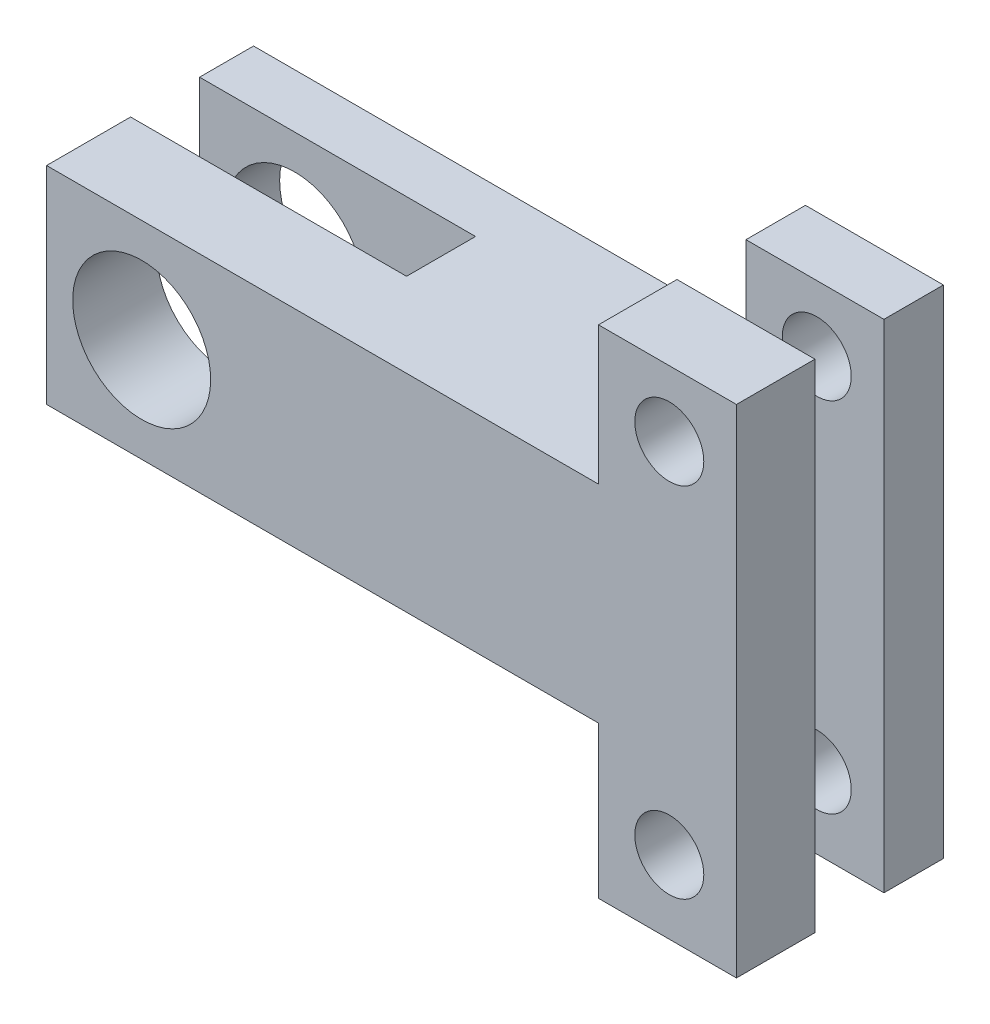
ISO-10303-21;
HEADER;
FILE_DESCRIPTION(('STEP AP214'),'2;1');
FILE_NAME('part.step','',(''),(''),'','','');
FILE_SCHEMA(('AUTOMOTIVE_DESIGN { 1 0 10303 214 1 1 1 1 }'));
ENDSEC;
DATA;
#1=APPLICATION_CONTEXT('core data for automotive mechanical design processes');
#2=APPLICATION_PROTOCOL_DEFINITION('international standard','automotive_design',2000,#1);
#3=PRODUCT_CONTEXT('',#1,'mechanical');
#4=PRODUCT('Part','Part','',(#3));
#5=PRODUCT_RELATED_PRODUCT_CATEGORY('part','',(#4));
#6=PRODUCT_DEFINITION_FORMATION('','',#4);
#7=PRODUCT_DEFINITION_CONTEXT('part definition',#1,'design');
#8=PRODUCT_DEFINITION('design','',#6,#7);
#9=PRODUCT_DEFINITION_SHAPE('','',#8);
#10=(LENGTH_UNIT() NAMED_UNIT(*) SI_UNIT(.MILLI.,.METRE.));
#11=(NAMED_UNIT(*) PLANE_ANGLE_UNIT() SI_UNIT($,.RADIAN.));
#12=(NAMED_UNIT(*) SI_UNIT($,.STERADIAN.) SOLID_ANGLE_UNIT());
#13=UNCERTAINTY_MEASURE_WITH_UNIT(LENGTH_MEASURE(1.E-05),#10,'distance_accuracy_value','');
#14=(GEOMETRIC_REPRESENTATION_CONTEXT(3) GLOBAL_UNCERTAINTY_ASSIGNED_CONTEXT((#13)) GLOBAL_UNIT_ASSIGNED_CONTEXT((#10,
#11,#12)) REPRESENTATION_CONTEXT('',''));
#15=CARTESIAN_POINT('',(0.,0.,0.));
#16=DIRECTION('',(0.,0.,1.));
#17=DIRECTION('',(1.,0.,0.));
#18=AXIS2_PLACEMENT_3D('',#15,#16,#17);
#19=CARTESIAN_POINT('',(25.,-7.5,15.));
#20=DIRECTION('',(-1.,0.,0.));
#21=DIRECTION('',(0.,0.,1.));
#22=AXIS2_PLACEMENT_3D('',#19,#20,#21);
#23=PLANE('',#22);
#24=DIRECTION('',(0.,0.,-1.));
#25=VECTOR('',#24,1.);
#26=CARTESIAN_POINT('',(25.,17.5,0.));
#27=LINE('',#26,#25);
#28=CARTESIAN_POINT('',(25.,17.5,4.31082534023738));
#29=VERTEX_POINT('',#28);
#30=CARTESIAN_POINT('',(25.,17.5,0.));
#31=VERTEX_POINT('',#30);
#32=EDGE_CURVE('E207',#29,#31,#27,.T.);
#33=ORIENTED_EDGE('',*,*,#32,.F.);
#34=DIRECTION('',(0.,1.,0.));
#35=VECTOR('',#34,1.);
#36=CARTESIAN_POINT('',(25.,-18.5,4.31082534023738));
#37=LINE('',#36,#35);
#38=CARTESIAN_POINT('',(25.,-18.5,4.31082534023738));
#39=VERTEX_POINT('',#38);
#40=EDGE_CURVE('E298',#39,#29,#37,.T.);
#41=ORIENTED_EDGE('',*,*,#40,.F.);
#42=DIRECTION('',(0.,0.,1.));
#43=VECTOR('',#42,1.);
#44=CARTESIAN_POINT('',(25.,-18.5,15.));
#45=LINE('',#44,#43);
#46=CARTESIAN_POINT('',(25.,-18.5,0.));
#47=VERTEX_POINT('',#46);
#48=EDGE_CURVE('E322',#47,#39,#45,.T.);
#49=ORIENTED_EDGE('',*,*,#48,.F.);
#50=DIRECTION('',(0.,1.,0.));
#51=VECTOR('',#50,1.);
#52=CARTESIAN_POINT('',(25.,-7.5,0.));
#53=LINE('',#52,#51);
#54=EDGE_CURVE('E237',#47,#31,#53,.T.);
#55=ORIENTED_EDGE('',*,*,#54,.T.);
#56=EDGE_LOOP('',(#33,#41,#49,#55));
#57=FACE_BOUND('',#56,.T.);
#58=ADVANCED_FACE('F38',(#57),#23,.F.);
#59=CARTESIAN_POINT('',(15.,17.5,15.));
#60=DIRECTION('',(1.,0.,0.));
#61=DIRECTION('',(0.,0.,-1.));
#62=AXIS2_PLACEMENT_3D('',#59,#60,#61);
#63=PLANE('',#62);
#64=DIRECTION('',(0.,0.,1.));
#65=VECTOR('',#64,1.);
#66=CARTESIAN_POINT('',(15.,7.5,15.));
#67=LINE('',#66,#65);
#68=CARTESIAN_POINT('',(15.,7.5,0.));
#69=VERTEX_POINT('',#68);
#70=CARTESIAN_POINT('',(15.,7.5,4.31082534023738));
#71=VERTEX_POINT('',#70);
#72=EDGE_CURVE('E195',#69,#71,#67,.T.);
#73=ORIENTED_EDGE('',*,*,#72,.T.);
#74=DIRECTION('',(0.,1.,0.));
#75=VECTOR('',#74,1.);
#76=CARTESIAN_POINT('',(15.,-18.5,4.31082534023738));
#77=LINE('',#76,#75);
#78=CARTESIAN_POINT('',(15.,17.5,4.31082534023738));
#79=VERTEX_POINT('',#78);
#80=EDGE_CURVE('E176',#71,#79,#77,.T.);
#81=ORIENTED_EDGE('',*,*,#80,.T.);
#82=DIRECTION('',(0.,0.,1.));
#83=VECTOR('',#82,1.);
#84=CARTESIAN_POINT('',(15.,17.5,15.));
#85=LINE('',#84,#83);
#86=CARTESIAN_POINT('',(15.,17.5,0.));
#87=VERTEX_POINT('',#86);
#88=EDGE_CURVE('E194',#87,#79,#85,.T.);
#89=ORIENTED_EDGE('',*,*,#88,.F.);
#90=DIRECTION('',(0.,-1.,0.));
#91=VECTOR('',#90,1.);
#92=CARTESIAN_POINT('',(15.,17.5,0.));
#93=LINE('',#92,#91);
#94=EDGE_CURVE('E210',#87,#69,#93,.T.);
#95=ORIENTED_EDGE('',*,*,#94,.T.);
#96=EDGE_LOOP('',(#73,#81,#89,#95));
#97=FACE_BOUND('',#96,.T.);
#98=ADVANCED_FACE('F360',(#97),#63,.F.);
#99=CARTESIAN_POINT('',(0.,17.5,0.));
#100=DIRECTION('',(0.,-1.,0.));
#101=DIRECTION('',(0.,0.,-1.));
#102=AXIS2_PLACEMENT_3D('',#99,#100,#101);
#103=PLANE('',#102);
#104=ORIENTED_EDGE('',*,*,#88,.T.);
#105=DIRECTION('',(1.,0.,0.));
#106=VECTOR('',#105,1.);
#107=CARTESIAN_POINT('',(15.,17.5,4.31082534023738));
#108=LINE('',#107,#106);
#109=EDGE_CURVE('E286',#79,#29,#108,.T.);
#110=ORIENTED_EDGE('',*,*,#109,.T.);
#111=ORIENTED_EDGE('',*,*,#32,.T.);
#112=DIRECTION('',(-1.,0.,0.));
#113=VECTOR('',#112,1.);
#114=CARTESIAN_POINT('',(15.,17.5,0.));
#115=LINE('',#114,#113);
#116=EDGE_CURVE('E209',#31,#87,#115,.T.);
#117=ORIENTED_EDGE('',*,*,#116,.T.);
#118=EDGE_LOOP('',(#104,#110,#111,#117));
#119=FACE_BOUND('',#118,.T.);
#120=ADVANCED_FACE('F363',(#119),#103,.F.);
#121=CARTESIAN_POINT('',(15.,-18.5,0.));
#122=DIRECTION('',(1.,0.,0.));
#123=DIRECTION('',(0.,0.,-1.));
#124=AXIS2_PLACEMENT_3D('',#121,#122,#123);
#125=PLANE('',#124);
#126=DIRECTION('',(0.,0.,-1.));
#127=VECTOR('',#126,1.);
#128=CARTESIAN_POINT('',(15.,-18.5,0.));
#129=LINE('',#128,#127);
#130=CARTESIAN_POINT('',(15.,-18.5,4.31082534023738));
#131=VERTEX_POINT('',#130);
#132=CARTESIAN_POINT('',(15.,-18.5,0.));
#133=VERTEX_POINT('',#132);
#134=EDGE_CURVE('E318',#131,#133,#129,.T.);
#135=ORIENTED_EDGE('',*,*,#134,.F.);
#136=CARTESIAN_POINT('',(15.,-7.5,4.31082534023738));
#137=VERTEX_POINT('',#136);
#138=EDGE_CURVE('E188',#131,#137,#77,.T.);
#139=ORIENTED_EDGE('',*,*,#138,.T.);
#140=DIRECTION('',(0.,0.,-1.));
#141=VECTOR('',#140,1.);
#142=CARTESIAN_POINT('',(15.,-7.5,0.));
#143=LINE('',#142,#141);
#144=CARTESIAN_POINT('',(15.,-7.5,0.));
#145=VERTEX_POINT('',#144);
#146=EDGE_CURVE('E282',#137,#145,#143,.T.);
#147=ORIENTED_EDGE('',*,*,#146,.T.);
#148=DIRECTION('',(0.,1.,0.));
#149=VECTOR('',#148,1.);
#150=CARTESIAN_POINT('',(15.,-18.5,0.));
#151=LINE('',#150,#149);
#152=EDGE_CURVE('E204',#133,#145,#151,.T.);
#153=ORIENTED_EDGE('',*,*,#152,.F.);
#154=EDGE_LOOP('',(#135,#139,#147,#153));
#155=FACE_BOUND('',#154,.T.);
#156=ADVANCED_FACE('F394',(#155),#125,.F.);
#157=CARTESIAN_POINT('',(0.,-18.5,0.));
#158=DIRECTION('',(0.,1.,0.));
#159=DIRECTION('',(0.,0.,1.));
#160=AXIS2_PLACEMENT_3D('',#157,#158,#159);
#161=PLANE('',#160);
#162=ORIENTED_EDGE('',*,*,#48,.T.);
#163=DIRECTION('',(1.,0.,0.));
#164=VECTOR('',#163,1.);
#165=CARTESIAN_POINT('',(15.,-18.5,4.31082534023738));
#166=LINE('',#165,#164);
#167=EDGE_CURVE('E292',#131,#39,#166,.T.);
#168=ORIENTED_EDGE('',*,*,#167,.F.);
#169=ORIENTED_EDGE('',*,*,#134,.T.);
#170=DIRECTION('',(1.,0.,0.));
#171=VECTOR('',#170,1.);
#172=CARTESIAN_POINT('',(25.,-18.5,0.));
#173=LINE('',#172,#171);
#174=EDGE_CURVE('E317',#133,#47,#173,.T.);
#175=ORIENTED_EDGE('',*,*,#174,.T.);
#176=EDGE_LOOP('',(#162,#168,#169,#175));
#177=FACE_BOUND('',#176,.T.);
#178=ADVANCED_FACE('F397',(#177),#161,.F.);
#179=CARTESIAN_POINT('',(20.1321170179302,-13.2024071660749,-9.99999999999997));
#180=DIRECTION('',(0.,0.,1.));
#181=DIRECTION('',(1.,0.,0.));
#182=AXIS2_PLACEMENT_3D('',#179,#180,#181);
#183=CYLINDRICAL_SURFACE('',#182,2.5);
#184=CARTESIAN_POINT('',(20.1321170179302,-13.2024071660749,4.31082534023738));
#185=DIRECTION('',(0.,0.,-1.));
#186=DIRECTION('',(0.,1.,0.));
#187=AXIS2_PLACEMENT_3D('',#184,#185,#186);
#188=CIRCLE('',#187,2.5);
#189=CARTESIAN_POINT('',(20.1321170179302,-10.7024071660749,4.31082534023738));
#190=VERTEX_POINT('',#189);
#191=EDGE_CURVE('E302',#190,#190,#188,.F.);
#192=ORIENTED_EDGE('',*,*,#191,.T.);
#193=EDGE_LOOP('',(#192));
#194=FACE_BOUND('',#193,.T.);
#195=CARTESIAN_POINT('',(20.1321170179302,-13.2024071660749,0.));
#196=DIRECTION('',(0.,0.,-1.));
#197=DIRECTION('',(-1.,0.,0.));
#198=AXIS2_PLACEMENT_3D('',#195,#196,#197);
#199=CIRCLE('',#198,2.5);
#200=CARTESIAN_POINT('',(17.6321170179302,-13.2024071660749,0.));
#201=VERTEX_POINT('',#200);
#202=EDGE_CURVE('E276',#201,#201,#199,.T.);
#203=ORIENTED_EDGE('',*,*,#202,.T.);
#204=EDGE_LOOP('',(#203));
#205=FACE_BOUND('',#204,.T.);
#206=ADVANCED_FACE('F408',(#194,#205),#183,.F.);
#207=CARTESIAN_POINT('',(20.1321170179302,12.7350028543801,-9.99999999999997));
#208=DIRECTION('',(0.,0.,1.));
#209=DIRECTION('',(1.,0.,0.));
#210=AXIS2_PLACEMENT_3D('',#207,#208,#209);
#211=CYLINDRICAL_SURFACE('',#210,2.5);
#212=CARTESIAN_POINT('',(20.1321170179302,12.7350028543801,4.31082534023738));
#213=DIRECTION('',(0.,0.,-1.));
#214=DIRECTION('',(0.,1.,0.));
#215=AXIS2_PLACEMENT_3D('',#212,#213,#214);
#216=CIRCLE('',#215,2.5);
#217=CARTESIAN_POINT('',(20.1321170179302,15.2350028543801,4.31082534023738));
#218=VERTEX_POINT('',#217);
#219=EDGE_CURVE('E42',#218,#218,#216,.F.);
#220=ORIENTED_EDGE('',*,*,#219,.T.);
#221=EDGE_LOOP('',(#220));
#222=FACE_BOUND('',#221,.T.);
#223=CARTESIAN_POINT('',(20.1321170179302,12.7350028543801,0.));
#224=DIRECTION('',(0.,0.,-1.));
#225=DIRECTION('',(-1.,0.,0.));
#226=AXIS2_PLACEMENT_3D('',#223,#224,#225);
#227=CIRCLE('',#226,2.5);
#228=CARTESIAN_POINT('',(17.6321170179302,12.7350028543801,0.));
#229=VERTEX_POINT('',#228);
#230=EDGE_CURVE('E279',#229,#229,#227,.T.);
#231=ORIENTED_EDGE('',*,*,#230,.T.);
#232=EDGE_LOOP('',(#231));
#233=FACE_BOUND('',#232,.T.);
#234=ADVANCED_FACE('F411',(#222,#233),#211,.F.);
#235=CARTESIAN_POINT('',(-25.,-7.5,15.));
#236=DIRECTION('',(0.,1.,0.));
#237=DIRECTION('',(0.,0.,1.));
#238=AXIS2_PLACEMENT_3D('',#235,#236,#237);
#239=PLANE('',#238);
#240=CARTESIAN_POINT('',(15.,-7.5,15.));
#241=VERTEX_POINT('',#240);
#242=CARTESIAN_POINT('',(15.,-7.5,9.31082534023738));
#243=VERTEX_POINT('',#242);
#244=EDGE_CURVE('E63',#241,#243,#143,.T.);
#245=ORIENTED_EDGE('',*,*,#244,.F.);
#246=DIRECTION('',(1.,0.,0.));
#247=VECTOR('',#246,1.);
#248=CARTESIAN_POINT('',(-25.,-7.5,15.));
#249=LINE('',#248,#247);
#250=CARTESIAN_POINT('',(-25.,-7.5,15.));
#251=VERTEX_POINT('',#250);
#252=EDGE_CURVE('E250',#251,#241,#249,.T.);
#253=ORIENTED_EDGE('',*,*,#252,.F.);
#254=DIRECTION('',(0.,0.,-1.));
#255=VECTOR('',#254,1.);
#256=CARTESIAN_POINT('',(-25.,-7.5,15.));
#257=LINE('',#256,#255);
#258=CARTESIAN_POINT('',(-25.,-7.5,8.91137857400828));
#259=VERTEX_POINT('',#258);
#260=EDGE_CURVE('E262',#251,#259,#257,.T.);
#261=ORIENTED_EDGE('',*,*,#260,.T.);
#262=DIRECTION('',(1.,0.,0.));
#263=VECTOR('',#262,1.);
#264=CARTESIAN_POINT('',(-25.,-7.5,8.91137857400828));
#265=LINE('',#264,#263);
#266=CARTESIAN_POINT('',(-5.,-7.5,8.91137857400828));
#267=VERTEX_POINT('',#266);
#268=EDGE_CURVE('E269',#259,#267,#265,.T.);
#269=ORIENTED_EDGE('',*,*,#268,.T.);
#270=DIRECTION('',(0.,0.,-1.));
#271=VECTOR('',#270,1.);
#272=CARTESIAN_POINT('',(-5.,-7.5,15.));
#273=LINE('',#272,#271);
#274=CARTESIAN_POINT('',(-5.,-7.5,3.91137857400828));
#275=VERTEX_POINT('',#274);
#276=EDGE_CURVE('E47',#267,#275,#273,.T.);
#277=ORIENTED_EDGE('',*,*,#276,.T.);
#278=DIRECTION('',(-1.,0.,0.));
#279=VECTOR('',#278,1.);
#280=CARTESIAN_POINT('',(-25.,-7.5,3.91137857400828));
#281=LINE('',#280,#279);
#282=CARTESIAN_POINT('',(-25.,-7.5,3.91137857400828));
#283=VERTEX_POINT('',#282);
#284=EDGE_CURVE('E11',#275,#283,#281,.T.);
#285=ORIENTED_EDGE('',*,*,#284,.T.);
#286=CARTESIAN_POINT('',(-25.,-7.5,0.));
#287=VERTEX_POINT('',#286);
#288=EDGE_CURVE('E252',#283,#287,#257,.T.);
#289=ORIENTED_EDGE('',*,*,#288,.T.);
#290=DIRECTION('',(1.,0.,0.));
#291=VECTOR('',#290,1.);
#292=CARTESIAN_POINT('',(-25.,-7.5,0.));
#293=LINE('',#292,#291);
#294=EDGE_CURVE('E246',#287,#145,#293,.T.);
#295=ORIENTED_EDGE('',*,*,#294,.T.);
#296=ORIENTED_EDGE('',*,*,#146,.F.);
#297=DIRECTION('',(0.,0.,-1.));
#298=VECTOR('',#297,1.);
#299=CARTESIAN_POINT('',(15.,-7.5,15.));
#300=LINE('',#299,#298);
#301=EDGE_CURVE('E307',#243,#137,#300,.T.);
#302=ORIENTED_EDGE('',*,*,#301,.F.);
#303=EDGE_LOOP('',(#245,#253,#261,#269,#277,#285,#289,#295,#296,#302));
#304=FACE_BOUND('',#303,.T.);
#305=ADVANCED_FACE('F378',(#304),#239,.F.);
#306=CARTESIAN_POINT('',(-25.,7.5,15.));
#307=DIRECTION('',(0.,-1.,0.));
#308=DIRECTION('',(0.,0.,-1.));
#309=AXIS2_PLACEMENT_3D('',#306,#307,#308);
#310=PLANE('',#309);
#311=ORIENTED_EDGE('',*,*,#72,.F.);
#312=DIRECTION('',(-1.,0.,0.));
#313=VECTOR('',#312,1.);
#314=CARTESIAN_POINT('',(-25.,7.5,0.));
#315=LINE('',#314,#313);
#316=CARTESIAN_POINT('',(-25.,7.5,0.));
#317=VERTEX_POINT('',#316);
#318=EDGE_CURVE('E255',#69,#317,#315,.T.);
#319=ORIENTED_EDGE('',*,*,#318,.T.);
#320=DIRECTION('',(0.,0.,-1.));
#321=VECTOR('',#320,1.);
#322=CARTESIAN_POINT('',(-25.,7.5,15.));
#323=LINE('',#322,#321);
#324=CARTESIAN_POINT('',(-25.,7.5,3.91137857400828));
#325=VERTEX_POINT('',#324);
#326=EDGE_CURVE('E265',#325,#317,#323,.T.);
#327=ORIENTED_EDGE('',*,*,#326,.F.);
#328=DIRECTION('',(-1.,0.,0.));
#329=VECTOR('',#328,1.);
#330=CARTESIAN_POINT('',(-25.,7.5,3.91137857400828));
#331=LINE('',#330,#329);
#332=CARTESIAN_POINT('',(-5.,7.5,3.91137857400828));
#333=VERTEX_POINT('',#332);
#334=EDGE_CURVE('E231',#333,#325,#331,.T.);
#335=ORIENTED_EDGE('',*,*,#334,.F.);
#336=DIRECTION('',(0.,0.,-1.));
#337=VECTOR('',#336,1.);
#338=CARTESIAN_POINT('',(-5.,7.5,3.91137857400828));
#339=LINE('',#338,#337);
#340=CARTESIAN_POINT('',(-5.,7.5,8.91137857400828));
#341=VERTEX_POINT('',#340);
#342=EDGE_CURVE('E228',#341,#333,#339,.T.);
#343=ORIENTED_EDGE('',*,*,#342,.F.);
#344=DIRECTION('',(1.,0.,0.));
#345=VECTOR('',#344,1.);
#346=CARTESIAN_POINT('',(-5.,7.5,8.91137857400828));
#347=LINE('',#346,#345);
#348=CARTESIAN_POINT('',(-25.,7.5,8.91137857400828));
#349=VERTEX_POINT('',#348);
#350=EDGE_CURVE('E225',#349,#341,#347,.T.);
#351=ORIENTED_EDGE('',*,*,#350,.F.);
#352=CARTESIAN_POINT('',(-25.,7.5,15.));
#353=VERTEX_POINT('',#352);
#354=EDGE_CURVE('E266',#353,#349,#323,.T.);
#355=ORIENTED_EDGE('',*,*,#354,.F.);
#356=DIRECTION('',(-1.,0.,0.));
#357=VECTOR('',#356,1.);
#358=CARTESIAN_POINT('',(-25.,7.5,15.));
#359=LINE('',#358,#357);
#360=CARTESIAN_POINT('',(15.,7.5,15.));
#361=VERTEX_POINT('',#360);
#362=EDGE_CURVE('E245',#361,#353,#359,.T.);
#363=ORIENTED_EDGE('',*,*,#362,.F.);
#364=CARTESIAN_POINT('',(15.,7.5,9.31082534023738));
#365=VERTEX_POINT('',#364);
#366=EDGE_CURVE('E200',#365,#361,#67,.T.);
#367=ORIENTED_EDGE('',*,*,#366,.F.);
#368=DIRECTION('',(0.,0.,1.));
#369=VECTOR('',#368,1.);
#370=CARTESIAN_POINT('',(15.,7.5,15.));
#371=LINE('',#370,#369);
#372=EDGE_CURVE('E305',#71,#365,#371,.T.);
#373=ORIENTED_EDGE('',*,*,#372,.F.);
#374=EDGE_LOOP('',(#311,#319,#327,#335,#343,#351,#355,#363,#367,#373));
#375=FACE_BOUND('',#374,.T.);
#376=ADVANCED_FACE('F341',(#375),#310,.F.);
#377=CARTESIAN_POINT('',(-25.,-7.5,15.));
#378=DIRECTION('',(1.,0.,0.));
#379=DIRECTION('',(0.,0.,-1.));
#380=AXIS2_PLACEMENT_3D('',#377,#378,#379);
#381=PLANE('',#380);
#382=ORIENTED_EDGE('',*,*,#288,.F.);
#383=DIRECTION('',(0.,1.,0.));
#384=VECTOR('',#383,1.);
#385=CARTESIAN_POINT('',(-25.,-22.5,3.91137857400828));
#386=LINE('',#385,#384);
#387=EDGE_CURVE('E234',#283,#325,#386,.T.);
#388=ORIENTED_EDGE('',*,*,#387,.T.);
#389=ORIENTED_EDGE('',*,*,#326,.T.);
#390=DIRECTION('',(0.,-1.,0.));
#391=VECTOR('',#390,1.);
#392=CARTESIAN_POINT('',(-25.,-7.5,0.));
#393=LINE('',#392,#391);
#394=EDGE_CURVE('E257',#317,#287,#393,.T.);
#395=ORIENTED_EDGE('',*,*,#394,.T.);
#396=EDGE_LOOP('',(#382,#388,#389,#395));
#397=FACE_BOUND('',#396,.T.);
#398=ADVANCED_FACE('F374',(#397),#381,.F.);
#399=CARTESIAN_POINT('',(25.,-18.5,9.31082534023738));
#400=VERTEX_POINT('',#399);
#401=CARTESIAN_POINT('',(25.,-18.5,15.));
#402=VERTEX_POINT('',#401);
#403=EDGE_CURVE('E321',#400,#402,#45,.T.);
#404=ORIENTED_EDGE('',*,*,#403,.F.);
#405=DIRECTION('',(0.,-1.,0.));
#406=VECTOR('',#405,1.);
#407=CARTESIAN_POINT('',(25.,17.5,9.31082534023738));
#408=LINE('',#407,#406);
#409=CARTESIAN_POINT('',(25.,17.5,9.31082534023738));
#410=VERTEX_POINT('',#409);
#411=EDGE_CURVE('E55',#410,#400,#408,.T.);
#412=ORIENTED_EDGE('',*,*,#411,.F.);
#413=CARTESIAN_POINT('',(25.,17.5,15.));
#414=VERTEX_POINT('',#413);
#415=EDGE_CURVE('E186',#414,#410,#27,.T.);
#416=ORIENTED_EDGE('',*,*,#415,.F.);
#417=DIRECTION('',(0.,1.,0.));
#418=VECTOR('',#417,1.);
#419=CARTESIAN_POINT('',(25.,-7.5,15.));
#420=LINE('',#419,#418);
#421=EDGE_CURVE('E243',#402,#414,#420,.T.);
#422=ORIENTED_EDGE('',*,*,#421,.F.);
#423=EDGE_LOOP('',(#404,#412,#416,#422));
#424=FACE_BOUND('',#423,.T.);
#425=ADVANCED_FACE('F40',(#424),#23,.F.);
#426=ORIENTED_EDGE('',*,*,#354,.T.);
#427=DIRECTION('',(0.,1.,0.));
#428=VECTOR('',#427,1.);
#429=CARTESIAN_POINT('',(-25.,-22.5,8.91137857400828));
#430=LINE('',#429,#428);
#431=EDGE_CURVE('E233',#259,#349,#430,.T.);
#432=ORIENTED_EDGE('',*,*,#431,.F.);
#433=ORIENTED_EDGE('',*,*,#260,.F.);
#434=DIRECTION('',(0.,-1.,0.));
#435=VECTOR('',#434,1.);
#436=CARTESIAN_POINT('',(-25.,-7.5,15.));
#437=LINE('',#436,#435);
#438=EDGE_CURVE('E248',#353,#251,#437,.T.);
#439=ORIENTED_EDGE('',*,*,#438,.F.);
#440=EDGE_LOOP('',(#426,#432,#433,#439));
#441=FACE_BOUND('',#440,.T.);
#442=ADVANCED_FACE('F386',(#441),#381,.F.);
#443=CARTESIAN_POINT('',(0.,0.,15.));
#444=DIRECTION('',(0.,0.,-1.));
#445=DIRECTION('',(-1.,0.,0.));
#446=AXIS2_PLACEMENT_3D('',#443,#444,#445);
#447=PLANE('',#446);
#448=CARTESIAN_POINT('',(20.1321170179302,12.7350028543801,15.));
#449=DIRECTION('',(0.,0.,1.));
#450=DIRECTION('',(1.,0.,0.));
#451=AXIS2_PLACEMENT_3D('',#448,#449,#450);
#452=CIRCLE('',#451,2.5);
#453=CARTESIAN_POINT('',(22.6321170179302,12.7350028543801,15.));
#454=VERTEX_POINT('',#453);
#455=EDGE_CURVE('E280',#454,#454,#452,.T.);
#456=ORIENTED_EDGE('',*,*,#455,.F.);
#457=EDGE_LOOP('',(#456));
#458=FACE_BOUND('',#457,.T.);
#459=CARTESIAN_POINT('',(20.1321170179302,-13.2024071660749,15.));
#460=DIRECTION('',(0.,0.,1.));
#461=DIRECTION('',(1.,0.,0.));
#462=AXIS2_PLACEMENT_3D('',#459,#460,#461);
#463=CIRCLE('',#462,2.5);
#464=CARTESIAN_POINT('',(22.6321170179302,-13.2024071660749,15.));
#465=VERTEX_POINT('',#464);
#466=EDGE_CURVE('E309',#465,#465,#463,.T.);
#467=ORIENTED_EDGE('',*,*,#466,.F.);
#468=EDGE_LOOP('',(#467));
#469=FACE_BOUND('',#468,.T.);
#470=CARTESIAN_POINT('',(-18.1082534023711,0.,15.));
#471=DIRECTION('',(0.,0.,1.));
#472=DIRECTION('',(1.,0.,0.));
#473=AXIS2_PLACEMENT_3D('',#470,#471,#472);
#474=CIRCLE('',#473,5.);
#475=CARTESIAN_POINT('',(-13.108253402371,0.,15.));
#476=VERTEX_POINT('',#475);
#477=EDGE_CURVE('E215',#476,#476,#474,.T.);
#478=ORIENTED_EDGE('',*,*,#477,.F.);
#479=EDGE_LOOP('',(#478));
#480=FACE_BOUND('',#479,.T.);
#481=ORIENTED_EDGE('',*,*,#421,.T.);
#482=DIRECTION('',(1.,0.,0.));
#483=VECTOR('',#482,1.);
#484=CARTESIAN_POINT('',(25.,17.5,15.));
#485=LINE('',#484,#483);
#486=CARTESIAN_POINT('',(15.,17.5,15.));
#487=VERTEX_POINT('',#486);
#488=EDGE_CURVE('E198',#487,#414,#485,.T.);
#489=ORIENTED_EDGE('',*,*,#488,.F.);
#490=DIRECTION('',(0.,-1.,0.));
#491=VECTOR('',#490,1.);
#492=CARTESIAN_POINT('',(15.,17.5,15.));
#493=LINE('',#492,#491);
#494=EDGE_CURVE('E193',#487,#361,#493,.T.);
#495=ORIENTED_EDGE('',*,*,#494,.T.);
#496=ORIENTED_EDGE('',*,*,#362,.T.);
#497=ORIENTED_EDGE('',*,*,#438,.T.);
#498=ORIENTED_EDGE('',*,*,#252,.T.);
#499=DIRECTION('',(0.,1.,0.));
#500=VECTOR('',#499,1.);
#501=CARTESIAN_POINT('',(15.,-18.5,15.));
#502=LINE('',#501,#500);
#503=CARTESIAN_POINT('',(15.,-18.5,15.));
#504=VERTEX_POINT('',#503);
#505=EDGE_CURVE('E327',#504,#241,#502,.T.);
#506=ORIENTED_EDGE('',*,*,#505,.F.);
#507=DIRECTION('',(-1.,0.,0.));
#508=VECTOR('',#507,1.);
#509=CARTESIAN_POINT('',(15.,-18.5,15.));
#510=LINE('',#509,#508);
#511=EDGE_CURVE('E325',#402,#504,#510,.T.);
#512=ORIENTED_EDGE('',*,*,#511,.F.);
#513=EDGE_LOOP('',(#481,#489,#495,#496,#497,#498,#506,#512));
#514=FACE_BOUND('',#513,.T.);
#515=ADVANCED_FACE('F345',(#458,#469,#480,#514),#447,.F.);
#516=CARTESIAN_POINT('',(0.,0.,0.));
#517=DIRECTION('',(0.,0.,-1.));
#518=DIRECTION('',(-1.,0.,0.));
#519=AXIS2_PLACEMENT_3D('',#516,#517,#518);
#520=PLANE('',#519);
#521=ORIENTED_EDGE('',*,*,#230,.F.);
#522=EDGE_LOOP('',(#521));
#523=FACE_BOUND('',#522,.T.);
#524=ORIENTED_EDGE('',*,*,#202,.F.);
#525=EDGE_LOOP('',(#524));
#526=FACE_BOUND('',#525,.T.);
#527=CARTESIAN_POINT('',(-18.1082534023711,0.,0.));
#528=DIRECTION('',(0.,0.,-1.));
#529=DIRECTION('',(-1.,0.,0.));
#530=AXIS2_PLACEMENT_3D('',#527,#528,#529);
#531=CIRCLE('',#530,5.);
#532=CARTESIAN_POINT('',(-23.1082534023711,0.,0.));
#533=VERTEX_POINT('',#532);
#534=EDGE_CURVE('E222',#533,#533,#531,.T.);
#535=ORIENTED_EDGE('',*,*,#534,.F.);
#536=EDGE_LOOP('',(#535));
#537=FACE_BOUND('',#536,.T.);
#538=ORIENTED_EDGE('',*,*,#54,.F.);
#539=ORIENTED_EDGE('',*,*,#174,.F.);
#540=ORIENTED_EDGE('',*,*,#152,.T.);
#541=ORIENTED_EDGE('',*,*,#294,.F.);
#542=ORIENTED_EDGE('',*,*,#394,.F.);
#543=ORIENTED_EDGE('',*,*,#318,.F.);
#544=ORIENTED_EDGE('',*,*,#94,.F.);
#545=ORIENTED_EDGE('',*,*,#116,.F.);
#546=EDGE_LOOP('',(#538,#539,#540,#541,#542,#543,#544,#545));
#547=FACE_BOUND('',#546,.T.);
#548=ADVANCED_FACE('F367',(#523,#526,#537,#547),#520,.T.);
#549=CARTESIAN_POINT('',(-25.,-22.5,3.91137857400828));
#550=DIRECTION('',(0.,0.,-1.));
#551=DIRECTION('',(-1.,0.,0.));
#552=AXIS2_PLACEMENT_3D('',#549,#550,#551);
#553=PLANE('',#552);
#554=CARTESIAN_POINT('',(-18.1082534023711,0.,3.91137857400828));
#555=DIRECTION('',(0.,0.,-1.));
#556=DIRECTION('',(-1.,0.,0.));
#557=AXIS2_PLACEMENT_3D('',#554,#555,#556);
#558=CIRCLE('',#557,5.);
#559=CARTESIAN_POINT('',(-23.1082534023711,0.,3.91137857400828));
#560=VERTEX_POINT('',#559);
#561=EDGE_CURVE('E219',#560,#560,#558,.T.);
#562=ORIENTED_EDGE('',*,*,#561,.T.);
#563=EDGE_LOOP('',(#562));
#564=FACE_BOUND('',#563,.T.);
#565=DIRECTION('',(0.,1.,0.));
#566=VECTOR('',#565,1.);
#567=CARTESIAN_POINT('',(-5.,-22.5,3.91137857400828));
#568=LINE('',#567,#566);
#569=EDGE_CURVE('E238',#275,#333,#568,.T.);
#570=ORIENTED_EDGE('',*,*,#569,.T.);
#571=ORIENTED_EDGE('',*,*,#334,.T.);
#572=ORIENTED_EDGE('',*,*,#387,.F.);
#573=ORIENTED_EDGE('',*,*,#284,.F.);
#574=EDGE_LOOP('',(#570,#571,#572,#573));
#575=FACE_BOUND('',#574,.T.);
#576=ADVANCED_FACE('F376',(#564,#575),#553,.F.);
#577=CARTESIAN_POINT('',(-5.,-22.5,3.91137857400828));
#578=DIRECTION('',(1.,0.,0.));
#579=DIRECTION('',(0.,0.,-1.));
#580=AXIS2_PLACEMENT_3D('',#577,#578,#579);
#581=PLANE('',#580);
#582=DIRECTION('',(0.,1.,0.));
#583=VECTOR('',#582,1.);
#584=CARTESIAN_POINT('',(-5.,-22.5,8.91137857400828));
#585=LINE('',#584,#583);
#586=EDGE_CURVE('E240',#267,#341,#585,.T.);
#587=ORIENTED_EDGE('',*,*,#586,.T.);
#588=ORIENTED_EDGE('',*,*,#342,.T.);
#589=ORIENTED_EDGE('',*,*,#569,.F.);
#590=ORIENTED_EDGE('',*,*,#276,.F.);
#591=EDGE_LOOP('',(#587,#588,#589,#590));
#592=FACE_BOUND('',#591,.T.);
#593=ADVANCED_FACE('F381',(#592),#581,.F.);
#594=CARTESIAN_POINT('',(-5.,-22.5,8.91137857400828));
#595=DIRECTION('',(0.,0.,1.));
#596=DIRECTION('',(1.,0.,0.));
#597=AXIS2_PLACEMENT_3D('',#594,#595,#596);
#598=PLANE('',#597);
#599=CARTESIAN_POINT('',(-18.1082534023711,0.,8.91137857400828));
#600=DIRECTION('',(0.,0.,1.));
#601=DIRECTION('',(1.,0.,0.));
#602=AXIS2_PLACEMENT_3D('',#599,#600,#601);
#603=CIRCLE('',#602,5.);
#604=CARTESIAN_POINT('',(-13.108253402371,0.,8.91137857400828));
#605=VERTEX_POINT('',#604);
#606=EDGE_CURVE('E218',#605,#605,#603,.T.);
#607=ORIENTED_EDGE('',*,*,#606,.T.);
#608=EDGE_LOOP('',(#607));
#609=FACE_BOUND('',#608,.T.);
#610=ORIENTED_EDGE('',*,*,#431,.T.);
#611=ORIENTED_EDGE('',*,*,#350,.T.);
#612=ORIENTED_EDGE('',*,*,#586,.F.);
#613=ORIENTED_EDGE('',*,*,#268,.F.);
#614=EDGE_LOOP('',(#610,#611,#612,#613));
#615=FACE_BOUND('',#614,.T.);
#616=ADVANCED_FACE('F435',(#609,#615),#598,.F.);
#617=CARTESIAN_POINT('',(-18.1082534023711,0.,-15.));
#618=DIRECTION('',(0.,0.,1.));
#619=DIRECTION('',(1.,0.,0.));
#620=AXIS2_PLACEMENT_3D('',#617,#618,#619);
#621=CYLINDRICAL_SURFACE('',#620,5.);
#622=ORIENTED_EDGE('',*,*,#477,.T.);
#623=EDGE_LOOP('',(#622));
#624=FACE_BOUND('',#623,.T.);
#625=ORIENTED_EDGE('',*,*,#606,.F.);
#626=EDGE_LOOP('',(#625));
#627=FACE_BOUND('',#626,.T.);
#628=ADVANCED_FACE('F425',(#624,#627),#621,.F.);
#629=ORIENTED_EDGE('',*,*,#534,.T.);
#630=EDGE_LOOP('',(#629));
#631=FACE_BOUND('',#630,.T.);
#632=ORIENTED_EDGE('',*,*,#561,.F.);
#633=EDGE_LOOP('',(#632));
#634=FACE_BOUND('',#633,.T.);
#635=ADVANCED_FACE('F422',(#631,#634),#621,.F.);
#636=CARTESIAN_POINT('',(15.,17.5,9.31082534023738));
#637=VERTEX_POINT('',#636);
#638=EDGE_CURVE('E183',#637,#487,#85,.T.);
#639=ORIENTED_EDGE('',*,*,#638,.F.);
#640=DIRECTION('',(0.,-1.,0.));
#641=VECTOR('',#640,1.);
#642=CARTESIAN_POINT('',(15.,17.5,9.31082534023738));
#643=LINE('',#642,#641);
#644=EDGE_CURVE('E166',#637,#365,#643,.T.);
#645=ORIENTED_EDGE('',*,*,#644,.T.);
#646=ORIENTED_EDGE('',*,*,#366,.T.);
#647=ORIENTED_EDGE('',*,*,#494,.F.);
#648=EDGE_LOOP('',(#639,#645,#646,#647));
#649=FACE_BOUND('',#648,.T.);
#650=ADVANCED_FACE('F191',(#649),#63,.F.);
#651=ORIENTED_EDGE('',*,*,#415,.T.);
#652=DIRECTION('',(1.,0.,0.));
#653=VECTOR('',#652,1.);
#654=CARTESIAN_POINT('',(15.,17.5,9.31082534023738));
#655=LINE('',#654,#653);
#656=EDGE_CURVE('E170',#637,#410,#655,.T.);
#657=ORIENTED_EDGE('',*,*,#656,.F.);
#658=ORIENTED_EDGE('',*,*,#638,.T.);
#659=ORIENTED_EDGE('',*,*,#488,.T.);
#660=EDGE_LOOP('',(#651,#657,#658,#659));
#661=FACE_BOUND('',#660,.T.);
#662=ADVANCED_FACE('F181',(#661),#103,.F.);
#663=ORIENTED_EDGE('',*,*,#244,.T.);
#664=CARTESIAN_POINT('',(15.,-18.5,9.31082534023738));
#665=VERTEX_POINT('',#664);
#666=EDGE_CURVE('E178',#243,#665,#643,.T.);
#667=ORIENTED_EDGE('',*,*,#666,.T.);
#668=EDGE_CURVE('E314',#504,#665,#129,.T.);
#669=ORIENTED_EDGE('',*,*,#668,.F.);
#670=ORIENTED_EDGE('',*,*,#505,.T.);
#671=EDGE_LOOP('',(#663,#667,#669,#670));
#672=FACE_BOUND('',#671,.T.);
#673=ADVANCED_FACE('F389',(#672),#125,.F.);
#674=ORIENTED_EDGE('',*,*,#668,.T.);
#675=DIRECTION('',(1.,0.,0.));
#676=VECTOR('',#675,1.);
#677=CARTESIAN_POINT('',(15.,-18.5,9.31082534023738));
#678=LINE('',#677,#676);
#679=EDGE_CURVE('E187',#665,#400,#678,.T.);
#680=ORIENTED_EDGE('',*,*,#679,.T.);
#681=ORIENTED_EDGE('',*,*,#403,.T.);
#682=ORIENTED_EDGE('',*,*,#511,.T.);
#683=EDGE_LOOP('',(#674,#680,#681,#682));
#684=FACE_BOUND('',#683,.T.);
#685=ADVANCED_FACE('F391',(#684),#161,.F.);
#686=CARTESIAN_POINT('',(20.1321170179302,-13.2024071660749,9.31082534023738));
#687=DIRECTION('',(0.,0.,1.));
#688=DIRECTION('',(1.,0.,0.));
#689=AXIS2_PLACEMENT_3D('',#686,#687,#688);
#690=CIRCLE('',#689,2.5);
#691=CARTESIAN_POINT('',(22.6321170179302,-13.2024071660749,9.31082534023738));
#692=VERTEX_POINT('',#691);
#693=EDGE_CURVE('E285',#692,#692,#690,.F.);
#694=ORIENTED_EDGE('',*,*,#693,.T.);
#695=EDGE_LOOP('',(#694));
#696=FACE_BOUND('',#695,.T.);
#697=ORIENTED_EDGE('',*,*,#466,.T.);
#698=EDGE_LOOP('',(#697));
#699=FACE_BOUND('',#698,.T.);
#700=ADVANCED_FACE('F413',(#696,#699),#183,.F.);
#701=CARTESIAN_POINT('',(20.1321170179302,12.7350028543801,9.31082534023738));
#702=DIRECTION('',(0.,0.,1.));
#703=DIRECTION('',(1.,0.,0.));
#704=AXIS2_PLACEMENT_3D('',#701,#702,#703);
#705=CIRCLE('',#704,2.5);
#706=CARTESIAN_POINT('',(22.6321170179302,12.7350028543801,9.31082534023738));
#707=VERTEX_POINT('',#706);
#708=EDGE_CURVE('E283',#707,#707,#705,.F.);
#709=ORIENTED_EDGE('',*,*,#708,.T.);
#710=EDGE_LOOP('',(#709));
#711=FACE_BOUND('',#710,.T.);
#712=ORIENTED_EDGE('',*,*,#455,.T.);
#713=EDGE_LOOP('',(#712));
#714=FACE_BOUND('',#713,.T.);
#715=ADVANCED_FACE('F477',(#711,#714),#211,.F.);
#716=CARTESIAN_POINT('',(15.,0.,0.));
#717=DIRECTION('',(1.,0.,0.));
#718=DIRECTION('',(0.,0.,-1.));
#719=AXIS2_PLACEMENT_3D('',#716,#717,#718);
#720=PLANE('',#719);
#721=ORIENTED_EDGE('',*,*,#301,.T.);
#722=EDGE_CURVE('E352',#137,#71,#77,.T.);
#723=ORIENTED_EDGE('',*,*,#722,.T.);
#724=ORIENTED_EDGE('',*,*,#372,.T.);
#725=EDGE_CURVE('E172',#365,#243,#643,.T.);
#726=ORIENTED_EDGE('',*,*,#725,.T.);
#727=EDGE_LOOP('',(#721,#723,#724,#726));
#728=FACE_BOUND('',#727,.T.);
#729=ADVANCED_FACE('F393',(#728),#720,.T.);
#730=CARTESIAN_POINT('',(15.,-18.5,4.31082534023738));
#731=DIRECTION('',(0.,0.,-1.));
#732=DIRECTION('',(0.,1.,0.));
#733=AXIS2_PLACEMENT_3D('',#730,#731,#732);
#734=PLANE('',#733);
#735=ORIENTED_EDGE('',*,*,#219,.F.);
#736=EDGE_LOOP('',(#735));
#737=FACE_BOUND('',#736,.T.);
#738=ORIENTED_EDGE('',*,*,#40,.T.);
#739=ORIENTED_EDGE('',*,*,#109,.F.);
#740=ORIENTED_EDGE('',*,*,#80,.F.);
#741=ORIENTED_EDGE('',*,*,#722,.F.);
#742=ORIENTED_EDGE('',*,*,#138,.F.);
#743=ORIENTED_EDGE('',*,*,#167,.T.);
#744=EDGE_LOOP('',(#738,#739,#740,#741,#742,#743));
#745=FACE_BOUND('',#744,.T.);
#746=ORIENTED_EDGE('',*,*,#191,.F.);
#747=EDGE_LOOP('',(#746));
#748=FACE_BOUND('',#747,.T.);
#749=ADVANCED_FACE('F401',(#737,#745,#748),#734,.F.);
#750=CARTESIAN_POINT('',(15.,17.5,9.31082534023738));
#751=DIRECTION('',(0.,0.,1.));
#752=DIRECTION('',(1.,0.,0.));
#753=AXIS2_PLACEMENT_3D('',#750,#751,#752);
#754=PLANE('',#753);
#755=ORIENTED_EDGE('',*,*,#708,.F.);
#756=EDGE_LOOP('',(#755));
#757=FACE_BOUND('',#756,.T.);
#758=ORIENTED_EDGE('',*,*,#411,.T.);
#759=ORIENTED_EDGE('',*,*,#679,.F.);
#760=ORIENTED_EDGE('',*,*,#666,.F.);
#761=ORIENTED_EDGE('',*,*,#725,.F.);
#762=ORIENTED_EDGE('',*,*,#644,.F.);
#763=ORIENTED_EDGE('',*,*,#656,.T.);
#764=EDGE_LOOP('',(#758,#759,#760,#761,#762,#763));
#765=FACE_BOUND('',#764,.T.);
#766=ORIENTED_EDGE('',*,*,#693,.F.);
#767=EDGE_LOOP('',(#766));
#768=FACE_BOUND('',#767,.T.);
#769=ADVANCED_FACE('F168',(#757,#765,#768),#754,.F.);
#770=CLOSED_SHELL('',(#58,#98,#120,#156,#178,#206,#234,#305,#376,#398,#425,#442,#515,#548,#576,
#593,#616,#628,#635,#650,#662,#673,#685,#700,#715,#729,#749,#769));
#771=MANIFOLD_SOLID_BREP('B2',#770);
#772=ADVANCED_BREP_SHAPE_REPRESENTATION('',(#18,#771),#14);
#773=SHAPE_DEFINITION_REPRESENTATION(#9,#772);
ENDSEC;
END-ISO-10303-21;
